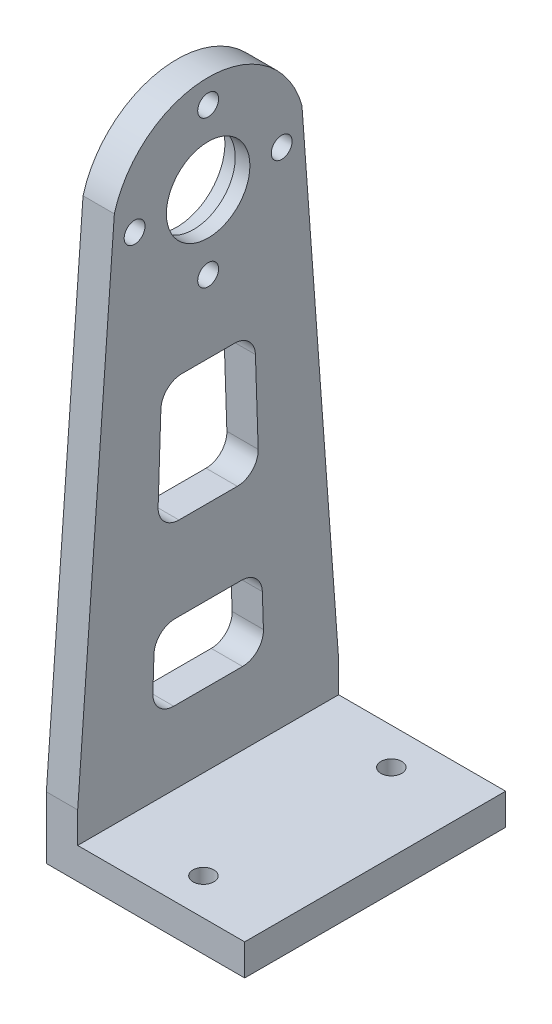
ISO-10303-21;
HEADER;
FILE_DESCRIPTION(('STEP AP214'),'2;1');
FILE_NAME('part.step','',(''),(''),'','','');
FILE_SCHEMA(('AUTOMOTIVE_DESIGN { 1 0 10303 214 1 1 1 1 }'));
ENDSEC;
DATA;
#1=APPLICATION_CONTEXT('core data for automotive mechanical design processes');
#2=APPLICATION_PROTOCOL_DEFINITION('international standard','automotive_design',2000,#1);
#3=PRODUCT_CONTEXT('',#1,'mechanical');
#4=PRODUCT('Part','Part','',(#3));
#5=PRODUCT_RELATED_PRODUCT_CATEGORY('part','',(#4));
#6=PRODUCT_DEFINITION_FORMATION('','',#4);
#7=PRODUCT_DEFINITION_CONTEXT('part definition',#1,'design');
#8=PRODUCT_DEFINITION('design','',#6,#7);
#9=PRODUCT_DEFINITION_SHAPE('','',#8);
#10=(LENGTH_UNIT() NAMED_UNIT(*) SI_UNIT(.MILLI.,.METRE.));
#11=(NAMED_UNIT(*) PLANE_ANGLE_UNIT() SI_UNIT($,.RADIAN.));
#12=(NAMED_UNIT(*) SI_UNIT($,.STERADIAN.) SOLID_ANGLE_UNIT());
#13=UNCERTAINTY_MEASURE_WITH_UNIT(LENGTH_MEASURE(1.E-05),#10,'distance_accuracy_value','');
#14=(GEOMETRIC_REPRESENTATION_CONTEXT(3) GLOBAL_UNCERTAINTY_ASSIGNED_CONTEXT((#13)) GLOBAL_UNIT_ASSIGNED_CONTEXT((#10,
#11,#12)) REPRESENTATION_CONTEXT('',''));
#15=CARTESIAN_POINT('',(0.,0.,0.));
#16=DIRECTION('',(0.,0.,1.));
#17=DIRECTION('',(1.,0.,0.));
#18=AXIS2_PLACEMENT_3D('',#15,#16,#17);
#19=CARTESIAN_POINT('',(15.5,-52.,0.));
#20=DIRECTION('',(-1.,0.,0.));
#21=DIRECTION('',(0.,0.,1.));
#22=AXIS2_PLACEMENT_3D('',#19,#20,#21);
#23=CYLINDRICAL_SURFACE('',#22,4.);
#24=CARTESIAN_POINT('',(16.5,-52.,0.));
#25=DIRECTION('',(-1.,0.,0.));
#26=DIRECTION('',(0.,0.,-1.));
#27=AXIS2_PLACEMENT_3D('',#24,#25,#26);
#28=CIRCLE('',#27,4.);
#29=CARTESIAN_POINT('',(16.5,-52.,-4.));
#30=VERTEX_POINT('',#29);
#31=EDGE_CURVE('E48',#30,#30,#28,.T.);
#32=ORIENTED_EDGE('',*,*,#31,.F.);
#33=EDGE_LOOP('',(#32));
#34=FACE_BOUND('',#33,.T.);
#35=CARTESIAN_POINT('',(15.1,-52.,0.));
#36=DIRECTION('',(-1.,0.,0.));
#37=DIRECTION('',(0.,0.,1.));
#38=AXIS2_PLACEMENT_3D('',#35,#36,#37);
#39=CIRCLE('',#38,4.);
#40=CARTESIAN_POINT('',(15.1,-52.,4.));
#41=VERTEX_POINT('',#40);
#42=EDGE_CURVE('E42',#41,#41,#39,.F.);
#43=ORIENTED_EDGE('',*,*,#42,.F.);
#44=EDGE_LOOP('',(#43));
#45=FACE_BOUND('',#44,.T.);
#46=ADVANCED_FACE('F39',(#34,#45),#23,.F.);
#47=CARTESIAN_POINT('',(16.5,-100.7,-12.5));
#48=DIRECTION('',(1.,0.,0.));
#49=DIRECTION('',(0.,-1.,0.));
#50=AXIS2_PLACEMENT_3D('',#47,#48,#49);
#51=PLANE('',#50);
#52=CARTESIAN_POINT('',(16.5,-59.0452123011725,1.54223501579341E-13));
#53=DIRECTION('',(-1.,0.,0.));
#54=DIRECTION('',(0.,0.,1.));
#55=AXIS2_PLACEMENT_3D('',#52,#53,#54);
#56=CIRCLE('',#55,1.);
#57=CARTESIAN_POINT('',(16.5,-59.0452123011725,1.00000000000015));
#58=VERTEX_POINT('',#57);
#59=EDGE_CURVE('E520',#58,#58,#56,.T.);
#60=ORIENTED_EDGE('',*,*,#59,.T.);
#61=EDGE_LOOP('',(#60));
#62=FACE_BOUND('',#61,.T.);
#63=CARTESIAN_POINT('',(16.5,-52.,7.04521230117253));
#64=DIRECTION('',(-1.,0.,0.));
#65=DIRECTION('',(0.,0.,1.));
#66=AXIS2_PLACEMENT_3D('',#63,#64,#65);
#67=CIRCLE('',#66,1.00000000000001);
#68=CARTESIAN_POINT('',(16.5,-52.,8.04521230117253));
#69=VERTEX_POINT('',#68);
#70=EDGE_CURVE('E526',#69,#69,#67,.T.);
#71=ORIENTED_EDGE('',*,*,#70,.T.);
#72=EDGE_LOOP('',(#71));
#73=FACE_BOUND('',#72,.T.);
#74=CARTESIAN_POINT('',(16.5,-52.0000000000001,-7.04521230117231));
#75=DIRECTION('',(-1.,0.,0.));
#76=DIRECTION('',(0.,0.,1.));
#77=AXIS2_PLACEMENT_3D('',#74,#75,#76);
#78=CIRCLE('',#77,1.);
#79=CARTESIAN_POINT('',(16.5,-52.0000000000001,-6.04521230117231));
#80=VERTEX_POINT('',#79);
#81=EDGE_CURVE('E532',#80,#80,#78,.T.);
#82=ORIENTED_EDGE('',*,*,#81,.T.);
#83=EDGE_LOOP('',(#82));
#84=FACE_BOUND('',#83,.T.);
#85=CARTESIAN_POINT('',(16.5,-44.9547876988277,0.));
#86=DIRECTION('',(-1.,0.,0.));
#87=DIRECTION('',(0.,0.,1.));
#88=AXIS2_PLACEMENT_3D('',#85,#86,#87);
#89=CIRCLE('',#88,1.);
#90=CARTESIAN_POINT('',(16.5,-44.9547876988277,1.00000000000001));
#91=VERTEX_POINT('',#90);
#92=EDGE_CURVE('E198',#91,#91,#89,.T.);
#93=ORIENTED_EDGE('',*,*,#92,.T.);
#94=EDGE_LOOP('',(#93));
#95=FACE_BOUND('',#94,.T.);
#96=DIRECTION('',(0.,-0.997297605701587,-0.0734675823876265));
#97=VECTOR('',#96,1.);
#98=CARTESIAN_POINT('',(16.5,-100.681108800183,-12.7564416540415));
#99=LINE('',#98,#97);
#100=CARTESIAN_POINT('',(16.5,-49.5,-8.986100377806));
#101=VERTEX_POINT('',#100);
#102=CARTESIAN_POINT('',(16.5,-97.2,-12.5));
#103=VERTEX_POINT('',#102);
#104=EDGE_CURVE('E173',#101,#103,#99,.T.);
#105=ORIENTED_EDGE('',*,*,#104,.F.);
#106=CARTESIAN_POINT('',(16.5,-52.0000000000001,0.));
#107=DIRECTION('',(1.,0.,0.));
#108=DIRECTION('',(0.,0.,-1.));
#109=AXIS2_PLACEMENT_3D('',#106,#107,#108);
#110=CIRCLE('',#109,9.32737905308911);
#111=CARTESIAN_POINT('',(16.5,-49.5,8.986100377806));
#112=VERTEX_POINT('',#111);
#113=EDGE_CURVE('E188',#101,#112,#110,.T.);
#114=ORIENTED_EDGE('',*,*,#113,.T.);
#115=DIRECTION('',(0.,0.997297605701587,-0.0734675823876265));
#116=VECTOR('',#115,1.);
#117=CARTESIAN_POINT('',(16.5,-98.8493826998868,12.6215045124945));
#118=LINE('',#117,#116);
#119=CARTESIAN_POINT('',(16.5,-97.2,12.5));
#120=VERTEX_POINT('',#119);
#121=EDGE_CURVE('E193',#120,#112,#118,.T.);
#122=ORIENTED_EDGE('',*,*,#121,.F.);
#123=DIRECTION('',(0.,1.,0.));
#124=VECTOR('',#123,1.);
#125=CARTESIAN_POINT('',(16.5,-100.7,12.5));
#126=LINE('',#125,#124);
#127=CARTESIAN_POINT('',(16.5,-100.149489742783,12.5));
#128=VERTEX_POINT('',#127);
#129=EDGE_CURVE('E153',#128,#120,#126,.T.);
#130=ORIENTED_EDGE('',*,*,#129,.F.);
#131=DIRECTION('',(0.,0.,1.));
#132=VECTOR('',#131,1.);
#133=CARTESIAN_POINT('',(16.5,-100.149489742783,12.5));
#134=LINE('',#133,#132);
#135=CARTESIAN_POINT('',(16.5,-100.149489742783,-12.5));
#136=VERTEX_POINT('',#135);
#137=EDGE_CURVE('E192',#136,#128,#134,.T.);
#138=ORIENTED_EDGE('',*,*,#137,.F.);
#139=DIRECTION('',(0.,1.,0.));
#140=VECTOR('',#139,1.);
#141=CARTESIAN_POINT('',(16.5,-100.7,-12.5));
#142=LINE('',#141,#140);
#143=EDGE_CURVE('E11',#136,#103,#142,.T.);
#144=ORIENTED_EDGE('',*,*,#143,.T.);
#145=EDGE_LOOP('',(#105,#114,#122,#130,#138,#144));
#146=FACE_BOUND('',#145,.T.);
#147=ORIENTED_EDGE('',*,*,#31,.T.);
#148=EDGE_LOOP('',(#147));
#149=FACE_BOUND('',#148,.T.);
#150=CARTESIAN_POINT('',(16.5,-91.2,-3.296767463509));
#151=DIRECTION('',(-1.,0.,0.));
#152=DIRECTION('',(0.,0.0330349000935773,-0.999454198738395));
#153=AXIS2_PLACEMENT_3D('',#150,#151,#152);
#154=CIRCLE('',#153,2.);
#155=CARTESIAN_POINT('',(16.5,-91.13393019981,-5.295675860986));
#156=VERTEX_POINT('',#155);
#157=CARTESIAN_POINT('',(16.5,-93.2,-3.296767463509));
#158=VERTEX_POINT('',#157);
#159=EDGE_CURVE('E260',#156,#158,#154,.T.);
#160=ORIENTED_EDGE('',*,*,#159,.T.);
#161=DIRECTION('',(0.,0.,-1.));
#162=VECTOR('',#161,1.);
#163=CARTESIAN_POINT('',(16.5,-93.2,3.296767463509));
#164=LINE('',#163,#162);
#165=CARTESIAN_POINT('',(16.5,-93.2,3.296767463509));
#166=VERTEX_POINT('',#165);
#167=EDGE_CURVE('E135',#166,#158,#164,.T.);
#168=ORIENTED_EDGE('',*,*,#167,.F.);
#169=CARTESIAN_POINT('',(16.5,-91.2,3.296767463509));
#170=DIRECTION('',(-1.,0.,0.));
#171=DIRECTION('',(0.,-1.,0.));
#172=AXIS2_PLACEMENT_3D('',#169,#170,#171);
#173=CIRCLE('',#172,2.);
#174=CARTESIAN_POINT('',(16.5,-91.13393019981,5.295675860986));
#175=VERTEX_POINT('',#174);
#176=EDGE_CURVE('E266',#166,#175,#173,.T.);
#177=ORIENTED_EDGE('',*,*,#176,.T.);
#178=DIRECTION('',(0.,-0.999454198738395,0.0330349000935798));
#179=VECTOR('',#178,1.);
#180=CARTESIAN_POINT('',(16.5,-87.93393019981,5.189906451609));
#181=LINE('',#180,#179);
#182=CARTESIAN_POINT('',(16.5,-87.93393019981,5.189906451609));
#183=VERTEX_POINT('',#182);
#184=EDGE_CURVE('E146',#183,#175,#181,.T.);
#185=ORIENTED_EDGE('',*,*,#184,.F.);
#186=CARTESIAN_POINT('',(16.5,-88.,3.190998054133));
#187=DIRECTION('',(-1.,0.,0.));
#188=DIRECTION('',(0.,0.0330349000935773,0.999454198738395));
#189=AXIS2_PLACEMENT_3D('',#186,#187,#188);
#190=CIRCLE('',#189,2.);
#191=CARTESIAN_POINT('',(16.5,-86.,3.190998054133));
#192=VERTEX_POINT('',#191);
#193=EDGE_CURVE('E127',#183,#192,#190,.T.);
#194=ORIENTED_EDGE('',*,*,#193,.T.);
#195=DIRECTION('',(0.,0.,1.));
#196=VECTOR('',#195,1.);
#197=CARTESIAN_POINT('',(16.5,-86.,-3.190998054133));
#198=LINE('',#197,#196);
#199=CARTESIAN_POINT('',(16.5,-86.,-3.190998054133));
#200=VERTEX_POINT('',#199);
#201=EDGE_CURVE('E102',#200,#192,#198,.T.);
#202=ORIENTED_EDGE('',*,*,#201,.F.);
#203=CARTESIAN_POINT('',(16.5,-88.,-3.190998054133));
#204=DIRECTION('',(-1.,0.,0.));
#205=DIRECTION('',(0.,1.,0.));
#206=AXIS2_PLACEMENT_3D('',#203,#204,#205);
#207=CIRCLE('',#206,2.);
#208=CARTESIAN_POINT('',(16.5,-87.93393019981,-5.189906451609));
#209=VERTEX_POINT('',#208);
#210=EDGE_CURVE('E121',#200,#209,#207,.T.);
#211=ORIENTED_EDGE('',*,*,#210,.T.);
#212=DIRECTION('',(0.,0.999454198738395,0.0330349000935798));
#213=VECTOR('',#212,1.);
#214=CARTESIAN_POINT('',(16.5,-91.13393019981,-5.295675860986));
#215=LINE('',#214,#213);
#216=EDGE_CURVE('E108',#156,#209,#215,.T.);
#217=ORIENTED_EDGE('',*,*,#216,.F.);
#218=EDGE_LOOP('',(#160,#168,#177,#185,#194,#202,#211,#217));
#219=FACE_BOUND('',#218,.T.);
#220=CARTESIAN_POINT('',(16.5,-68.,-2.529939245529));
#221=DIRECTION('',(-1.,0.,0.));
#222=DIRECTION('',(0.,1.,0.));
#223=AXIS2_PLACEMENT_3D('',#220,#221,#222);
#224=CIRCLE('',#223,2.);
#225=CARTESIAN_POINT('',(16.5,-66.,-2.529939245529));
#226=VERTEX_POINT('',#225);
#227=CARTESIAN_POINT('',(16.5,-67.93393019981,-4.528847643006));
#228=VERTEX_POINT('',#227);
#229=EDGE_CURVE('E240',#226,#228,#224,.T.);
#230=ORIENTED_EDGE('',*,*,#229,.T.);
#231=DIRECTION('',(0.,0.999454198738395,0.0330349000935798));
#232=VECTOR('',#231,1.);
#233=CARTESIAN_POINT('',(16.5,-75.93393019981,-4.793271166447));
#234=LINE('',#233,#232);
#235=CARTESIAN_POINT('',(16.5,-75.93393019981,-4.793271166447));
#236=VERTEX_POINT('',#235);
#237=EDGE_CURVE('E57',#236,#228,#234,.T.);
#238=ORIENTED_EDGE('',*,*,#237,.F.);
#239=CARTESIAN_POINT('',(16.5,-76.,-2.794362768971));
#240=DIRECTION('',(-1.,0.,0.));
#241=DIRECTION('',(0.,0.0330349000935773,-0.999454198738395));
#242=AXIS2_PLACEMENT_3D('',#239,#240,#241);
#243=CIRCLE('',#242,2.);
#244=CARTESIAN_POINT('',(16.5,-78.,-2.794362768971));
#245=VERTEX_POINT('',#244);
#246=EDGE_CURVE('E242',#236,#245,#243,.T.);
#247=ORIENTED_EDGE('',*,*,#246,.T.);
#248=DIRECTION('',(0.,0.,-1.));
#249=VECTOR('',#248,1.);
#250=CARTESIAN_POINT('',(16.5,-78.,2.794362768971));
#251=LINE('',#250,#249);
#252=CARTESIAN_POINT('',(16.5,-78.,2.794362768971));
#253=VERTEX_POINT('',#252);
#254=EDGE_CURVE('E249',#253,#245,#251,.T.);
#255=ORIENTED_EDGE('',*,*,#254,.F.);
#256=CARTESIAN_POINT('',(16.5,-76.,2.794362768971));
#257=DIRECTION('',(-1.,0.,0.));
#258=DIRECTION('',(0.,-1.,0.));
#259=AXIS2_PLACEMENT_3D('',#256,#257,#258);
#260=CIRCLE('',#259,2.);
#261=CARTESIAN_POINT('',(16.5,-75.93393019981,4.793271166447));
#262=VERTEX_POINT('',#261);
#263=EDGE_CURVE('E248',#253,#262,#260,.T.);
#264=ORIENTED_EDGE('',*,*,#263,.T.);
#265=DIRECTION('',(0.,-0.999454198738395,0.0330349000935798));
#266=VECTOR('',#265,1.);
#267=CARTESIAN_POINT('',(16.5,-67.93393019981,4.528847643006));
#268=LINE('',#267,#266);
#269=CARTESIAN_POINT('',(16.5,-67.93393019981,4.528847643006));
#270=VERTEX_POINT('',#269);
#271=EDGE_CURVE('E128',#270,#262,#268,.T.);
#272=ORIENTED_EDGE('',*,*,#271,.F.);
#273=CARTESIAN_POINT('',(16.5,-68.,2.529939245529));
#274=DIRECTION('',(-1.,0.,0.));
#275=DIRECTION('',(0.,0.0330349000935773,0.999454198738395));
#276=AXIS2_PLACEMENT_3D('',#273,#274,#275);
#277=CIRCLE('',#276,2.);
#278=CARTESIAN_POINT('',(16.5,-66.,2.529939245529));
#279=VERTEX_POINT('',#278);
#280=EDGE_CURVE('E255',#270,#279,#277,.T.);
#281=ORIENTED_EDGE('',*,*,#280,.T.);
#282=DIRECTION('',(0.,0.,1.));
#283=VECTOR('',#282,1.);
#284=CARTESIAN_POINT('',(16.5,-66.,-2.529939245529));
#285=LINE('',#284,#283);
#286=EDGE_CURVE('E261',#226,#279,#285,.T.);
#287=ORIENTED_EDGE('',*,*,#286,.F.);
#288=EDGE_LOOP('',(#230,#238,#247,#255,#264,#272,#281,#287));
#289=FACE_BOUND('',#288,.T.);
#290=ADVANCED_FACE('F122',(#62,#73,#84,#95,#146,#149,#219,#289),#51,.T.);
#291=CARTESIAN_POINT('',(15.5,-70.85,12.5));
#292=DIRECTION('',(0.,0.,-1.));
#293=DIRECTION('',(0.,-1.,0.));
#294=AXIS2_PLACEMENT_3D('',#291,#292,#293);
#295=PLANE('',#294);
#296=DIRECTION('',(-1.,0.,0.));
#297=VECTOR('',#296,1.);
#298=CARTESIAN_POINT('',(32.5,-100.149489742783,12.5));
#299=LINE('',#298,#297);
#300=CARTESIAN_POINT('',(32.5,-100.149489742783,12.5));
#301=VERTEX_POINT('',#300);
#302=EDGE_CURVE('E223',#301,#128,#299,.T.);
#303=ORIENTED_EDGE('',*,*,#302,.T.);
#304=ORIENTED_EDGE('',*,*,#129,.T.);
#305=DIRECTION('',(-1.,0.,0.));
#306=VECTOR('',#305,1.);
#307=CARTESIAN_POINT('',(16.5,-97.2,12.5));
#308=LINE('',#307,#306);
#309=CARTESIAN_POINT('',(13.5,-97.2,12.5));
#310=VERTEX_POINT('',#309);
#311=EDGE_CURVE('E159',#120,#310,#308,.T.);
#312=ORIENTED_EDGE('',*,*,#311,.T.);
#313=DIRECTION('',(0.,-1.,0.));
#314=VECTOR('',#313,1.);
#315=CARTESIAN_POINT('',(13.5,0.,12.5));
#316=LINE('',#315,#314);
#317=CARTESIAN_POINT('',(13.5,-103.149489742783,12.5));
#318=VERTEX_POINT('',#317);
#319=EDGE_CURVE('E384',#310,#318,#316,.T.);
#320=ORIENTED_EDGE('',*,*,#319,.T.);
#321=DIRECTION('',(-1.,0.,0.));
#322=VECTOR('',#321,1.);
#323=CARTESIAN_POINT('',(75.6884089130718,-103.149489742783,12.5));
#324=LINE('',#323,#322);
#325=CARTESIAN_POINT('',(32.5,-103.149489742783,12.5));
#326=VERTEX_POINT('',#325);
#327=EDGE_CURVE('E231',#326,#318,#324,.T.);
#328=ORIENTED_EDGE('',*,*,#327,.F.);
#329=DIRECTION('',(0.,-1.,0.));
#330=VECTOR('',#329,1.);
#331=CARTESIAN_POINT('',(32.5,-103.149489742783,12.5));
#332=LINE('',#331,#330);
#333=EDGE_CURVE('E211',#301,#326,#332,.T.);
#334=ORIENTED_EDGE('',*,*,#333,.F.);
#335=EDGE_LOOP('',(#303,#304,#312,#320,#328,#334));
#336=FACE_BOUND('',#335,.T.);
#337=ADVANCED_FACE('F376',(#336),#295,.F.);
#338=CARTESIAN_POINT('',(15.93933982822,-101.76066017178,-12.5));
#339=DIRECTION('',(0.,0.,-1.));
#340=DIRECTION('',(1.,0.,0.));
#341=AXIS2_PLACEMENT_3D('',#338,#339,#340);
#342=PLANE('',#341);
#343=DIRECTION('',(-1.,0.,0.));
#344=VECTOR('',#343,1.);
#345=CARTESIAN_POINT('',(75.6884089130718,-103.149489742783,-12.5));
#346=LINE('',#345,#344);
#347=CARTESIAN_POINT('',(32.5,-103.149489742783,-12.5));
#348=VERTEX_POINT('',#347);
#349=CARTESIAN_POINT('',(13.5,-103.149489742783,-12.5));
#350=VERTEX_POINT('',#349);
#351=EDGE_CURVE('E158',#348,#350,#346,.T.);
#352=ORIENTED_EDGE('',*,*,#351,.T.);
#353=DIRECTION('',(0.,1.,0.));
#354=VECTOR('',#353,1.);
#355=CARTESIAN_POINT('',(13.5,0.,-12.5));
#356=LINE('',#355,#354);
#357=CARTESIAN_POINT('',(13.5,-97.2,-12.5));
#358=VERTEX_POINT('',#357);
#359=EDGE_CURVE('E392',#350,#358,#356,.T.);
#360=ORIENTED_EDGE('',*,*,#359,.T.);
#361=DIRECTION('',(-1.,0.,0.));
#362=VECTOR('',#361,1.);
#363=CARTESIAN_POINT('',(16.5,-97.2,-12.5));
#364=LINE('',#363,#362);
#365=EDGE_CURVE('E162',#103,#358,#364,.T.);
#366=ORIENTED_EDGE('',*,*,#365,.F.);
#367=ORIENTED_EDGE('',*,*,#143,.F.);
#368=DIRECTION('',(-1.,0.,0.));
#369=VECTOR('',#368,1.);
#370=CARTESIAN_POINT('',(32.5,-100.149489742783,-12.5));
#371=LINE('',#370,#369);
#372=CARTESIAN_POINT('',(32.5,-100.149489742783,-12.5));
#373=VERTEX_POINT('',#372);
#374=EDGE_CURVE('E228',#373,#136,#371,.T.);
#375=ORIENTED_EDGE('',*,*,#374,.F.);
#376=DIRECTION('',(0.,1.,0.));
#377=VECTOR('',#376,1.);
#378=CARTESIAN_POINT('',(32.5,-100.149489742783,-12.5));
#379=LINE('',#378,#377);
#380=EDGE_CURVE('E217',#348,#373,#379,.T.);
#381=ORIENTED_EDGE('',*,*,#380,.F.);
#382=EDGE_LOOP('',(#352,#360,#366,#367,#375,#381));
#383=FACE_BOUND('',#382,.T.);
#384=ADVANCED_FACE('F477',(#383),#342,.T.);
#385=CARTESIAN_POINT('',(15.5,-72.,4.663243205897));
#386=DIRECTION('',(0.,0.0330349000935798,0.999454198738395));
#387=DIRECTION('',(0.,0.999454198738395,-0.0330349000935798));
#388=AXIS2_PLACEMENT_3D('',#385,#386,#387);
#389=PLANE('',#388);
#390=ORIENTED_EDGE('',*,*,#271,.T.);
#391=DIRECTION('',(-1.,0.,0.));
#392=VECTOR('',#391,1.);
#393=CARTESIAN_POINT('',(16.5,-75.93393019981,4.793271166447));
#394=LINE('',#393,#392);
#395=CARTESIAN_POINT('',(13.5,-75.93393019981,4.79327116644733));
#396=VERTEX_POINT('',#395);
#397=EDGE_CURVE('E257',#262,#396,#394,.T.);
#398=ORIENTED_EDGE('',*,*,#397,.T.);
#399=DIRECTION('',(0.,0.999454198738395,-0.0330349000935798));
#400=VECTOR('',#399,1.);
#401=CARTESIAN_POINT('',(13.5,0.0753917599162948,2.28093957557516));
#402=LINE('',#401,#400);
#403=CARTESIAN_POINT('',(13.5,-67.93393019981,4.5288476430057));
#404=VERTEX_POINT('',#403);
#405=EDGE_CURVE('E328',#396,#404,#402,.T.);
#406=ORIENTED_EDGE('',*,*,#405,.T.);
#407=DIRECTION('',(-1.,0.,0.));
#408=VECTOR('',#407,1.);
#409=CARTESIAN_POINT('',(16.5,-67.93393019981,4.528847643006));
#410=LINE('',#409,#408);
#411=EDGE_CURVE('E263',#270,#404,#410,.T.);
#412=ORIENTED_EDGE('',*,*,#411,.F.);
#413=EDGE_LOOP('',(#390,#398,#406,#412));
#414=FACE_BOUND('',#413,.T.);
#415=ADVANCED_FACE('F475',(#414),#389,.F.);
#416=CARTESIAN_POINT('',(118.162,-68.,2.529939245529));
#417=DIRECTION('',(-1.,0.,0.));
#418=DIRECTION('',(0.,-0.0330349000935773,-0.999454198738395));
#419=AXIS2_PLACEMENT_3D('',#416,#417,#418);
#420=CYLINDRICAL_SURFACE('',#419,2.);
#421=ORIENTED_EDGE('',*,*,#411,.T.);
#422=CARTESIAN_POINT('',(13.5,-68.,2.529939245529));
#423=DIRECTION('',(1.,0.,0.));
#424=DIRECTION('',(0.,0.,-1.));
#425=AXIS2_PLACEMENT_3D('',#422,#423,#424);
#426=CIRCLE('',#425,2.);
#427=CARTESIAN_POINT('',(13.5,-66.,2.529939245529));
#428=VERTEX_POINT('',#427);
#429=EDGE_CURVE('E207',#404,#428,#426,.F.);
#430=ORIENTED_EDGE('',*,*,#429,.T.);
#431=DIRECTION('',(-1.,0.,0.));
#432=VECTOR('',#431,1.);
#433=CARTESIAN_POINT('',(16.5,-66.,2.529939245529));
#434=LINE('',#433,#432);
#435=EDGE_CURVE('E264',#279,#428,#434,.T.);
#436=ORIENTED_EDGE('',*,*,#435,.F.);
#437=ORIENTED_EDGE('',*,*,#280,.F.);
#438=EDGE_LOOP('',(#421,#430,#436,#437));
#439=FACE_BOUND('',#438,.T.);
#440=ADVANCED_FACE('F339',(#439),#420,.F.);
#441=CARTESIAN_POINT('',(15.5,-66.,0.));
#442=DIRECTION('',(0.,1.,0.));
#443=DIRECTION('',(0.,0.,-1.));
#444=AXIS2_PLACEMENT_3D('',#441,#442,#443);
#445=PLANE('',#444);
#446=ORIENTED_EDGE('',*,*,#286,.T.);
#447=ORIENTED_EDGE('',*,*,#435,.T.);
#448=DIRECTION('',(0.,0.,-1.));
#449=VECTOR('',#448,1.);
#450=CARTESIAN_POINT('',(13.5,-66.,0.));
#451=LINE('',#450,#449);
#452=CARTESIAN_POINT('',(13.5,-66.,-2.529939245529));
#453=VERTEX_POINT('',#452);
#454=EDGE_CURVE('E308',#428,#453,#451,.T.);
#455=ORIENTED_EDGE('',*,*,#454,.T.);
#456=DIRECTION('',(-1.,0.,0.));
#457=VECTOR('',#456,1.);
#458=CARTESIAN_POINT('',(16.5,-66.,-2.529939245529));
#459=LINE('',#458,#457);
#460=EDGE_CURVE('E244',#226,#453,#459,.T.);
#461=ORIENTED_EDGE('',*,*,#460,.F.);
#462=EDGE_LOOP('',(#446,#447,#455,#461));
#463=FACE_BOUND('',#462,.T.);
#464=ADVANCED_FACE('F473',(#463),#445,.F.);
#465=CARTESIAN_POINT('',(118.162,-68.,-2.529939245529));
#466=DIRECTION('',(-1.,0.,0.));
#467=DIRECTION('',(0.,-1.,0.));
#468=AXIS2_PLACEMENT_3D('',#465,#466,#467);
#469=CYLINDRICAL_SURFACE('',#468,2.);
#470=ORIENTED_EDGE('',*,*,#460,.T.);
#471=CARTESIAN_POINT('',(13.5,-68.,-2.529939245529));
#472=DIRECTION('',(1.,0.,0.));
#473=DIRECTION('',(0.,0.,-1.));
#474=AXIS2_PLACEMENT_3D('',#471,#472,#473);
#475=CIRCLE('',#474,2.);
#476=CARTESIAN_POINT('',(13.5,-67.93393019981,-4.52884764300567));
#477=VERTEX_POINT('',#476);
#478=EDGE_CURVE('E311',#453,#477,#475,.F.);
#479=ORIENTED_EDGE('',*,*,#478,.T.);
#480=DIRECTION('',(-1.,0.,0.));
#481=VECTOR('',#480,1.);
#482=CARTESIAN_POINT('',(16.5,-67.93393019981,-4.528847643006));
#483=LINE('',#482,#481);
#484=EDGE_CURVE('E245',#228,#477,#483,.T.);
#485=ORIENTED_EDGE('',*,*,#484,.F.);
#486=ORIENTED_EDGE('',*,*,#229,.F.);
#487=EDGE_LOOP('',(#470,#479,#485,#486));
#488=FACE_BOUND('',#487,.T.);
#489=ADVANCED_FACE('F470',(#488),#469,.F.);
#490=CARTESIAN_POINT('',(15.5,-72.,-4.663243205897));
#491=DIRECTION('',(0.,0.0330349000935798,-0.999454198738395));
#492=DIRECTION('',(0.,-0.999454198738395,-0.0330349000935798));
#493=AXIS2_PLACEMENT_3D('',#490,#491,#492);
#494=PLANE('',#493);
#495=ORIENTED_EDGE('',*,*,#484,.T.);
#496=DIRECTION('',(0.,-0.999454198738395,-0.0330349000935798));
#497=VECTOR('',#496,1.);
#498=CARTESIAN_POINT('',(13.5,0.0753917599162838,-2.28093957557483));
#499=LINE('',#498,#497);
#500=CARTESIAN_POINT('',(13.5,-75.9339301998128,-4.79327116644779));
#501=VERTEX_POINT('',#500);
#502=EDGE_CURVE('E317',#477,#501,#499,.T.);
#503=ORIENTED_EDGE('',*,*,#502,.T.);
#504=DIRECTION('',(-1.,0.,0.));
#505=VECTOR('',#504,1.);
#506=CARTESIAN_POINT('',(16.5,-75.93393019981,-4.793271166447));
#507=LINE('',#506,#505);
#508=EDGE_CURVE('E251',#236,#501,#507,.T.);
#509=ORIENTED_EDGE('',*,*,#508,.F.);
#510=ORIENTED_EDGE('',*,*,#237,.T.);
#511=EDGE_LOOP('',(#495,#503,#509,#510));
#512=FACE_BOUND('',#511,.T.);
#513=ADVANCED_FACE('F466',(#512),#494,.F.);
#514=CARTESIAN_POINT('',(118.162,-76.,-2.794362768971));
#515=DIRECTION('',(-1.,0.,0.));
#516=DIRECTION('',(0.,-0.0330349000935773,0.999454198738395));
#517=AXIS2_PLACEMENT_3D('',#514,#515,#516);
#518=CYLINDRICAL_SURFACE('',#517,2.);
#519=ORIENTED_EDGE('',*,*,#508,.T.);
#520=CARTESIAN_POINT('',(13.5,-76.,-2.794362768971));
#521=DIRECTION('',(1.,0.,0.));
#522=DIRECTION('',(0.,0.,-1.));
#523=AXIS2_PLACEMENT_3D('',#520,#521,#522);
#524=CIRCLE('',#523,2.);
#525=CARTESIAN_POINT('',(13.5,-78.,-2.794362768971));
#526=VERTEX_POINT('',#525);
#527=EDGE_CURVE('E320',#501,#526,#524,.F.);
#528=ORIENTED_EDGE('',*,*,#527,.T.);
#529=DIRECTION('',(-1.,0.,0.));
#530=VECTOR('',#529,1.);
#531=CARTESIAN_POINT('',(16.5,-78.,-2.794362768971));
#532=LINE('',#531,#530);
#533=EDGE_CURVE('E252',#245,#526,#532,.T.);
#534=ORIENTED_EDGE('',*,*,#533,.F.);
#535=ORIENTED_EDGE('',*,*,#246,.F.);
#536=EDGE_LOOP('',(#519,#528,#534,#535));
#537=FACE_BOUND('',#536,.T.);
#538=ADVANCED_FACE('F464',(#537),#518,.F.);
#539=CARTESIAN_POINT('',(15.5,-78.,0.));
#540=DIRECTION('',(0.,-1.,0.));
#541=DIRECTION('',(0.,0.,1.));
#542=AXIS2_PLACEMENT_3D('',#539,#540,#541);
#543=PLANE('',#542);
#544=ORIENTED_EDGE('',*,*,#254,.T.);
#545=ORIENTED_EDGE('',*,*,#533,.T.);
#546=DIRECTION('',(0.,0.,1.));
#547=VECTOR('',#546,1.);
#548=CARTESIAN_POINT('',(13.5,-78.,0.));
#549=LINE('',#548,#547);
#550=CARTESIAN_POINT('',(13.5,-78.,2.794362768971));
#551=VERTEX_POINT('',#550);
#552=EDGE_CURVE('E323',#526,#551,#549,.T.);
#553=ORIENTED_EDGE('',*,*,#552,.T.);
#554=DIRECTION('',(-1.,0.,0.));
#555=VECTOR('',#554,1.);
#556=CARTESIAN_POINT('',(16.5,-78.,2.794362768971));
#557=LINE('',#556,#555);
#558=EDGE_CURVE('E272',#253,#551,#557,.T.);
#559=ORIENTED_EDGE('',*,*,#558,.F.);
#560=EDGE_LOOP('',(#544,#545,#553,#559));
#561=FACE_BOUND('',#560,.T.);
#562=ADVANCED_FACE('F460',(#561),#543,.F.);
#563=CARTESIAN_POINT('',(118.162,-76.,2.794362768971));
#564=DIRECTION('',(-1.,0.,0.));
#565=DIRECTION('',(0.,1.,0.));
#566=AXIS2_PLACEMENT_3D('',#563,#564,#565);
#567=CYLINDRICAL_SURFACE('',#566,2.);
#568=ORIENTED_EDGE('',*,*,#558,.T.);
#569=CARTESIAN_POINT('',(13.5,-76.,2.794362768971));
#570=DIRECTION('',(1.,0.,0.));
#571=DIRECTION('',(0.,0.,-1.));
#572=AXIS2_PLACEMENT_3D('',#569,#570,#571);
#573=CIRCLE('',#572,2.);
#574=EDGE_CURVE('E326',#551,#396,#573,.F.);
#575=ORIENTED_EDGE('',*,*,#574,.T.);
#576=ORIENTED_EDGE('',*,*,#397,.F.);
#577=ORIENTED_EDGE('',*,*,#263,.F.);
#578=EDGE_LOOP('',(#568,#575,#576,#577));
#579=FACE_BOUND('',#578,.T.);
#580=ADVANCED_FACE('F455',(#579),#567,.F.);
#581=CARTESIAN_POINT('',(15.5,-86.,0.));
#582=DIRECTION('',(0.,1.,0.));
#583=DIRECTION('',(0.,0.,-1.));
#584=AXIS2_PLACEMENT_3D('',#581,#582,#583);
#585=PLANE('',#584);
#586=ORIENTED_EDGE('',*,*,#201,.T.);
#587=DIRECTION('',(-1.,0.,0.));
#588=VECTOR('',#587,1.);
#589=CARTESIAN_POINT('',(16.5,-86.,3.190998054133));
#590=LINE('',#589,#588);
#591=CARTESIAN_POINT('',(13.5,-86.,3.190998054133));
#592=VERTEX_POINT('',#591);
#593=EDGE_CURVE('E273',#192,#592,#590,.T.);
#594=ORIENTED_EDGE('',*,*,#593,.T.);
#595=DIRECTION('',(0.,0.,-1.));
#596=VECTOR('',#595,1.);
#597=CARTESIAN_POINT('',(13.5,-86.,0.));
#598=LINE('',#597,#596);
#599=CARTESIAN_POINT('',(13.5,-86.,-3.190998054133));
#600=VERTEX_POINT('',#599);
#601=EDGE_CURVE('E297',#592,#600,#598,.T.);
#602=ORIENTED_EDGE('',*,*,#601,.T.);
#603=DIRECTION('',(-1.,0.,0.));
#604=VECTOR('',#603,1.);
#605=CARTESIAN_POINT('',(16.5,-86.,-3.190998054133));
#606=LINE('',#605,#604);
#607=EDGE_CURVE('E119',#200,#600,#606,.T.);
#608=ORIENTED_EDGE('',*,*,#607,.F.);
#609=EDGE_LOOP('',(#586,#594,#602,#608));
#610=FACE_BOUND('',#609,.T.);
#611=ADVANCED_FACE('F298',(#610),#585,.F.);
#612=CARTESIAN_POINT('',(118.162,-88.,-3.190998054133));
#613=DIRECTION('',(-1.,0.,0.));
#614=DIRECTION('',(0.,-1.,0.));
#615=AXIS2_PLACEMENT_3D('',#612,#613,#614);
#616=CYLINDRICAL_SURFACE('',#615,2.);
#617=ORIENTED_EDGE('',*,*,#607,.T.);
#618=CARTESIAN_POINT('',(13.5,-88.,-3.190998054133));
#619=DIRECTION('',(1.,0.,0.));
#620=DIRECTION('',(0.,0.,-1.));
#621=AXIS2_PLACEMENT_3D('',#618,#619,#620);
#622=CIRCLE('',#621,2.);
#623=CARTESIAN_POINT('',(13.5,-87.93393019981,-5.18990645160947));
#624=VERTEX_POINT('',#623);
#625=EDGE_CURVE('E133',#600,#624,#622,.F.);
#626=ORIENTED_EDGE('',*,*,#625,.T.);
#627=DIRECTION('',(-1.,0.,0.));
#628=VECTOR('',#627,1.);
#629=CARTESIAN_POINT('',(16.5,-87.93393019981,-5.189906451609));
#630=LINE('',#629,#628);
#631=EDGE_CURVE('E113',#209,#624,#630,.T.);
#632=ORIENTED_EDGE('',*,*,#631,.F.);
#633=ORIENTED_EDGE('',*,*,#210,.F.);
#634=EDGE_LOOP('',(#617,#626,#632,#633));
#635=FACE_BOUND('',#634,.T.);
#636=ADVANCED_FACE('F131',(#635),#616,.F.);
#637=CARTESIAN_POINT('',(15.5,-89.6,-5.244974957468));
#638=DIRECTION('',(0.,0.0330349000935798,-0.999454198738395));
#639=DIRECTION('',(0.,-0.999454198738395,-0.0330349000935798));
#640=AXIS2_PLACEMENT_3D('',#637,#638,#639);
#641=PLANE('',#640);
#642=ORIENTED_EDGE('',*,*,#631,.T.);
#643=DIRECTION('',(0.,-0.999454198738395,-0.0330349000935798));
#644=VECTOR('',#643,1.);
#645=CARTESIAN_POINT('',(13.5,0.0753917599162994,-2.2809395755753));
#646=LINE('',#645,#644);
#647=CARTESIAN_POINT('',(13.5,-91.13393019981,-5.295675860986));
#648=VERTEX_POINT('',#647);
#649=EDGE_CURVE('E307',#624,#648,#646,.T.);
#650=ORIENTED_EDGE('',*,*,#649,.T.);
#651=DIRECTION('',(-1.,0.,0.));
#652=VECTOR('',#651,1.);
#653=CARTESIAN_POINT('',(16.5,-91.13393019981,-5.295675860986));
#654=LINE('',#653,#652);
#655=EDGE_CURVE('E116',#156,#648,#654,.T.);
#656=ORIENTED_EDGE('',*,*,#655,.F.);
#657=ORIENTED_EDGE('',*,*,#216,.T.);
#658=EDGE_LOOP('',(#642,#650,#656,#657));
#659=FACE_BOUND('',#658,.T.);
#660=ADVANCED_FACE('F109',(#659),#641,.F.);
#661=CARTESIAN_POINT('',(118.162,-91.2,-3.296767463509));
#662=DIRECTION('',(-1.,0.,0.));
#663=DIRECTION('',(0.,-0.0330349000935773,0.999454198738395));
#664=AXIS2_PLACEMENT_3D('',#661,#662,#663);
#665=CYLINDRICAL_SURFACE('',#664,2.);
#666=ORIENTED_EDGE('',*,*,#655,.T.);
#667=CARTESIAN_POINT('',(13.5,-91.2,-3.296767463509));
#668=DIRECTION('',(1.,0.,0.));
#669=DIRECTION('',(0.,0.,-1.));
#670=AXIS2_PLACEMENT_3D('',#667,#668,#669);
#671=CIRCLE('',#670,2.);
#672=CARTESIAN_POINT('',(13.5,-93.2,-3.296767463509));
#673=VERTEX_POINT('',#672);
#674=EDGE_CURVE('E400',#648,#673,#671,.F.);
#675=ORIENTED_EDGE('',*,*,#674,.T.);
#676=DIRECTION('',(-1.,0.,0.));
#677=VECTOR('',#676,1.);
#678=CARTESIAN_POINT('',(16.5,-93.2,-3.296767463509));
#679=LINE('',#678,#677);
#680=EDGE_CURVE('E140',#158,#673,#679,.T.);
#681=ORIENTED_EDGE('',*,*,#680,.F.);
#682=ORIENTED_EDGE('',*,*,#159,.F.);
#683=EDGE_LOOP('',(#666,#675,#681,#682));
#684=FACE_BOUND('',#683,.T.);
#685=ADVANCED_FACE('F439',(#684),#665,.F.);
#686=CARTESIAN_POINT('',(15.5,-93.2,0.));
#687=DIRECTION('',(0.,-1.,0.));
#688=DIRECTION('',(0.,0.,1.));
#689=AXIS2_PLACEMENT_3D('',#686,#687,#688);
#690=PLANE('',#689);
#691=ORIENTED_EDGE('',*,*,#167,.T.);
#692=ORIENTED_EDGE('',*,*,#680,.T.);
#693=DIRECTION('',(0.,0.,1.));
#694=VECTOR('',#693,1.);
#695=CARTESIAN_POINT('',(13.5,-93.2,0.));
#696=LINE('',#695,#694);
#697=CARTESIAN_POINT('',(13.5,-93.2,3.296767463509));
#698=VERTEX_POINT('',#697);
#699=EDGE_CURVE('E403',#673,#698,#696,.T.);
#700=ORIENTED_EDGE('',*,*,#699,.T.);
#701=DIRECTION('',(-1.,0.,0.));
#702=VECTOR('',#701,1.);
#703=CARTESIAN_POINT('',(16.5,-93.2,3.296767463509));
#704=LINE('',#703,#702);
#705=EDGE_CURVE('E143',#166,#698,#704,.T.);
#706=ORIENTED_EDGE('',*,*,#705,.F.);
#707=EDGE_LOOP('',(#691,#692,#700,#706));
#708=FACE_BOUND('',#707,.T.);
#709=ADVANCED_FACE('F434',(#708),#690,.F.);
#710=CARTESIAN_POINT('',(118.162,-91.2,3.296767463509));
#711=DIRECTION('',(-1.,0.,0.));
#712=DIRECTION('',(0.,1.,0.));
#713=AXIS2_PLACEMENT_3D('',#710,#711,#712);
#714=CYLINDRICAL_SURFACE('',#713,2.);
#715=ORIENTED_EDGE('',*,*,#705,.T.);
#716=CARTESIAN_POINT('',(13.5,-91.2,3.296767463509));
#717=DIRECTION('',(1.,0.,0.));
#718=DIRECTION('',(0.,0.,-1.));
#719=AXIS2_PLACEMENT_3D('',#716,#717,#718);
#720=CIRCLE('',#719,2.);
#721=CARTESIAN_POINT('',(13.5,-91.13393019981,5.29567586098553));
#722=VERTEX_POINT('',#721);
#723=EDGE_CURVE('E406',#698,#722,#720,.F.);
#724=ORIENTED_EDGE('',*,*,#723,.T.);
#725=DIRECTION('',(-1.,0.,0.));
#726=VECTOR('',#725,1.);
#727=CARTESIAN_POINT('',(16.5,-91.13393019981,5.295675860986));
#728=LINE('',#727,#726);
#729=EDGE_CURVE('E147',#175,#722,#728,.T.);
#730=ORIENTED_EDGE('',*,*,#729,.F.);
#731=ORIENTED_EDGE('',*,*,#176,.F.);
#732=EDGE_LOOP('',(#715,#724,#730,#731));
#733=FACE_BOUND('',#732,.T.);
#734=ADVANCED_FACE('F428',(#733),#714,.F.);
#735=CARTESIAN_POINT('',(15.5,-89.6,5.244974957468));
#736=DIRECTION('',(0.,0.0330349000935798,0.999454198738395));
#737=DIRECTION('',(0.,0.999454198738395,-0.0330349000935798));
#738=AXIS2_PLACEMENT_3D('',#735,#736,#737);
#739=PLANE('',#738);
#740=ORIENTED_EDGE('',*,*,#184,.T.);
#741=ORIENTED_EDGE('',*,*,#729,.T.);
#742=DIRECTION('',(0.,0.999454198738395,-0.0330349000935798));
#743=VECTOR('',#742,1.);
#744=CARTESIAN_POINT('',(13.5,0.075391759916284,2.28093957557484));
#745=LINE('',#744,#743);
#746=CARTESIAN_POINT('',(13.5,-87.93393019981,5.1899064516097));
#747=VERTEX_POINT('',#746);
#748=EDGE_CURVE('E409',#722,#747,#745,.T.);
#749=ORIENTED_EDGE('',*,*,#748,.T.);
#750=DIRECTION('',(-1.,0.,0.));
#751=VECTOR('',#750,1.);
#752=CARTESIAN_POINT('',(16.5,-87.93393019981,5.189906451609));
#753=LINE('',#752,#751);
#754=EDGE_CURVE('E150',#183,#747,#753,.T.);
#755=ORIENTED_EDGE('',*,*,#754,.F.);
#756=EDGE_LOOP('',(#740,#741,#749,#755));
#757=FACE_BOUND('',#756,.T.);
#758=ADVANCED_FACE('F422',(#757),#739,.F.);
#759=CARTESIAN_POINT('',(118.162,-88.,3.190998054133));
#760=DIRECTION('',(-1.,0.,0.));
#761=DIRECTION('',(0.,-0.0330349000935773,-0.999454198738395));
#762=AXIS2_PLACEMENT_3D('',#759,#760,#761);
#763=CYLINDRICAL_SURFACE('',#762,2.);
#764=ORIENTED_EDGE('',*,*,#754,.T.);
#765=CARTESIAN_POINT('',(13.5,-88.,3.190998054133));
#766=DIRECTION('',(1.,0.,0.));
#767=DIRECTION('',(0.,0.,-1.));
#768=AXIS2_PLACEMENT_3D('',#765,#766,#767);
#769=CIRCLE('',#768,2.);
#770=EDGE_CURVE('E302',#747,#592,#769,.F.);
#771=ORIENTED_EDGE('',*,*,#770,.T.);
#772=ORIENTED_EDGE('',*,*,#593,.F.);
#773=ORIENTED_EDGE('',*,*,#193,.F.);
#774=EDGE_LOOP('',(#764,#771,#772,#773));
#775=FACE_BOUND('',#774,.T.);
#776=ADVANCED_FACE('F412',(#775),#763,.F.);
#777=CARTESIAN_POINT('',(75.6884089130718,-103.149489742783,-12.5));
#778=DIRECTION('',(0.,-1.,0.));
#779=DIRECTION('',(0.,0.,-1.));
#780=AXIS2_PLACEMENT_3D('',#777,#778,#779);
#781=PLANE('',#780);
#782=CARTESIAN_POINT('',(25.0500000000001,-103.149489742783,-9.00000000000004));
#783=DIRECTION('',(0.,-1.,0.));
#784=DIRECTION('',(0.,0.,-1.));
#785=AXIS2_PLACEMENT_3D('',#782,#783,#784);
#786=CIRCLE('',#785,0.999999999999619);
#787=CARTESIAN_POINT('',(25.0500000000001,-103.149489742783,-9.99999999999966));
#788=VERTEX_POINT('',#787);
#789=EDGE_CURVE('E500',#788,#788,#786,.T.);
#790=ORIENTED_EDGE('',*,*,#789,.F.);
#791=EDGE_LOOP('',(#790));
#792=FACE_BOUND('',#791,.T.);
#793=CARTESIAN_POINT('',(25.0500000000002,-103.149489742783,8.99999999999995));
#794=DIRECTION('',(0.,-1.,0.));
#795=DIRECTION('',(0.,0.,-1.));
#796=AXIS2_PLACEMENT_3D('',#793,#794,#795);
#797=CIRCLE('',#796,0.9999999999995);
#798=CARTESIAN_POINT('',(25.0500000000002,-103.149489742783,8.00000000000045));
#799=VERTEX_POINT('',#798);
#800=EDGE_CURVE('E515',#799,#799,#797,.T.);
#801=ORIENTED_EDGE('',*,*,#800,.F.);
#802=EDGE_LOOP('',(#801));
#803=FACE_BOUND('',#802,.T.);
#804=ORIENTED_EDGE('',*,*,#351,.F.);
#805=DIRECTION('',(0.,0.,-1.));
#806=VECTOR('',#805,1.);
#807=CARTESIAN_POINT('',(32.5,-103.149489742783,-12.5));
#808=LINE('',#807,#806);
#809=EDGE_CURVE('E214',#326,#348,#808,.T.);
#810=ORIENTED_EDGE('',*,*,#809,.F.);
#811=ORIENTED_EDGE('',*,*,#327,.T.);
#812=DIRECTION('',(0.,0.,-1.));
#813=VECTOR('',#812,1.);
#814=CARTESIAN_POINT('',(13.5,-103.149489742783,-12.5));
#815=LINE('',#814,#813);
#816=EDGE_CURVE('E391',#318,#350,#815,.T.);
#817=ORIENTED_EDGE('',*,*,#816,.T.);
#818=EDGE_LOOP('',(#804,#810,#811,#817));
#819=FACE_BOUND('',#818,.T.);
#820=ADVANCED_FACE('F567',(#792,#803,#819),#781,.T.);
#821=CARTESIAN_POINT('',(32.5,-100.149489742783,12.5));
#822=DIRECTION('',(0.,-1.,0.));
#823=DIRECTION('',(0.,0.,-1.));
#824=AXIS2_PLACEMENT_3D('',#821,#822,#823);
#825=PLANE('',#824);
#826=CARTESIAN_POINT('',(25.0500000000001,-100.149489742783,-9.00000000000004));
#827=DIRECTION('',(0.,1.,0.));
#828=DIRECTION('',(0.,0.,1.));
#829=AXIS2_PLACEMENT_3D('',#826,#827,#828);
#830=CIRCLE('',#829,0.999999999999619);
#831=CARTESIAN_POINT('',(25.0500000000001,-100.149489742783,-8.00000000000042));
#832=VERTEX_POINT('',#831);
#833=EDGE_CURVE('E497',#832,#832,#830,.T.);
#834=ORIENTED_EDGE('',*,*,#833,.F.);
#835=EDGE_LOOP('',(#834));
#836=FACE_BOUND('',#835,.T.);
#837=CARTESIAN_POINT('',(25.0500000000002,-100.149489742783,8.99999999999995));
#838=DIRECTION('',(0.,1.,0.));
#839=DIRECTION('',(0.,0.,1.));
#840=AXIS2_PLACEMENT_3D('',#837,#838,#839);
#841=CIRCLE('',#840,0.9999999999995);
#842=CARTESIAN_POINT('',(25.0500000000002,-100.149489742783,9.99999999999945));
#843=VERTEX_POINT('',#842);
#844=EDGE_CURVE('E512',#843,#843,#841,.T.);
#845=ORIENTED_EDGE('',*,*,#844,.F.);
#846=EDGE_LOOP('',(#845));
#847=FACE_BOUND('',#846,.T.);
#848=ORIENTED_EDGE('',*,*,#137,.T.);
#849=ORIENTED_EDGE('',*,*,#302,.F.);
#850=DIRECTION('',(0.,0.,1.));
#851=VECTOR('',#850,1.);
#852=CARTESIAN_POINT('',(32.5,-100.149489742783,12.5));
#853=LINE('',#852,#851);
#854=EDGE_CURVE('E220',#373,#301,#853,.T.);
#855=ORIENTED_EDGE('',*,*,#854,.F.);
#856=ORIENTED_EDGE('',*,*,#374,.T.);
#857=EDGE_LOOP('',(#848,#849,#855,#856));
#858=FACE_BOUND('',#857,.T.);
#859=ADVANCED_FACE('F370',(#836,#847,#858),#825,.F.);
#860=CARTESIAN_POINT('',(32.5,0.,0.));
#861=DIRECTION('',(-1.,0.,0.));
#862=DIRECTION('',(0.,0.,1.));
#863=AXIS2_PLACEMENT_3D('',#860,#861,#862);
#864=PLANE('',#863);
#865=ORIENTED_EDGE('',*,*,#333,.T.);
#866=ORIENTED_EDGE('',*,*,#809,.T.);
#867=ORIENTED_EDGE('',*,*,#380,.T.);
#868=ORIENTED_EDGE('',*,*,#854,.T.);
#869=EDGE_LOOP('',(#865,#866,#867,#868));
#870=FACE_BOUND('',#869,.T.);
#871=ADVANCED_FACE('F561',(#870),#864,.F.);
#872=CARTESIAN_POINT('',(22.,-49.5,-8.986100377806));
#873=DIRECTION('',(0.,-0.0734675823876265,0.997297605701587));
#874=DIRECTION('',(0.,-0.997297605701587,-0.0734675823876265));
#875=AXIS2_PLACEMENT_3D('',#872,#873,#874);
#876=PLANE('',#875);
#877=ORIENTED_EDGE('',*,*,#104,.T.);
#878=ORIENTED_EDGE('',*,*,#365,.T.);
#879=DIRECTION('',(0.,0.997297605701587,0.0734675823876265));
#880=VECTOR('',#879,1.);
#881=CARTESIAN_POINT('',(13.5,0.391227443813302,-5.31078035127329));
#882=LINE('',#881,#880);
#883=CARTESIAN_POINT('',(13.5,-49.5,-8.986100377806));
#884=VERTEX_POINT('',#883);
#885=EDGE_CURVE('E176',#358,#884,#882,.T.);
#886=ORIENTED_EDGE('',*,*,#885,.T.);
#887=DIRECTION('',(1.,0.,0.));
#888=VECTOR('',#887,1.);
#889=CARTESIAN_POINT('',(14.5,-49.5,-8.986100377806));
#890=LINE('',#889,#888);
#891=EDGE_CURVE('E157',#884,#101,#890,.T.);
#892=ORIENTED_EDGE('',*,*,#891,.T.);
#893=EDGE_LOOP('',(#877,#878,#886,#892));
#894=FACE_BOUND('',#893,.T.);
#895=ADVANCED_FACE('F171',(#894),#876,.F.);
#896=CARTESIAN_POINT('',(22.,-49.5,8.986100377806));
#897=DIRECTION('',(0.,-0.0734675823876265,-0.997297605701587));
#898=DIRECTION('',(0.,0.997297605701587,-0.0734675823876265));
#899=AXIS2_PLACEMENT_3D('',#896,#897,#898);
#900=PLANE('',#899);
#901=ORIENTED_EDGE('',*,*,#121,.T.);
#902=DIRECTION('',(1.,0.,0.));
#903=VECTOR('',#902,1.);
#904=CARTESIAN_POINT('',(14.5,-49.5,8.986100377806));
#905=LINE('',#904,#903);
#906=CARTESIAN_POINT('',(13.5,-49.5,8.986100377806));
#907=VERTEX_POINT('',#906);
#908=EDGE_CURVE('E154',#907,#112,#905,.T.);
#909=ORIENTED_EDGE('',*,*,#908,.F.);
#910=DIRECTION('',(0.,-0.997297605701587,0.0734675823876265));
#911=VECTOR('',#910,1.);
#912=CARTESIAN_POINT('',(13.5,0.391227443813302,5.31078035127329));
#913=LINE('',#912,#911);
#914=EDGE_CURVE('E200',#907,#310,#913,.T.);
#915=ORIENTED_EDGE('',*,*,#914,.T.);
#916=ORIENTED_EDGE('',*,*,#311,.F.);
#917=EDGE_LOOP('',(#901,#909,#915,#916));
#918=FACE_BOUND('',#917,.T.);
#919=ADVANCED_FACE('F378',(#918),#900,.F.);
#920=CARTESIAN_POINT('',(13.5,-52.0000000000001,0.));
#921=DIRECTION('',(1.,0.,0.));
#922=DIRECTION('',(0.,0.,-1.));
#923=AXIS2_PLACEMENT_3D('',#920,#921,#922);
#924=CYLINDRICAL_SURFACE('',#923,9.32737905308911);
#925=ORIENTED_EDGE('',*,*,#113,.F.);
#926=ORIENTED_EDGE('',*,*,#891,.F.);
#927=CARTESIAN_POINT('',(13.5,-52.0000000000001,0.));
#928=DIRECTION('',(1.,0.,0.));
#929=DIRECTION('',(0.,0.,-1.));
#930=AXIS2_PLACEMENT_3D('',#927,#928,#929);
#931=CIRCLE('',#930,9.32737905308911);
#932=EDGE_CURVE('E197',#884,#907,#931,.T.);
#933=ORIENTED_EDGE('',*,*,#932,.T.);
#934=ORIENTED_EDGE('',*,*,#908,.T.);
#935=EDGE_LOOP('',(#925,#926,#933,#934));
#936=FACE_BOUND('',#935,.T.);
#937=ADVANCED_FACE('F195',(#936),#924,.T.);
#938=CARTESIAN_POINT('',(13.5,0.,0.));
#939=DIRECTION('',(1.,0.,0.));
#940=DIRECTION('',(0.,0.,-1.));
#941=AXIS2_PLACEMENT_3D('',#938,#939,#940);
#942=PLANE('',#941);
#943=CARTESIAN_POINT('',(13.5,-52.0000000000001,0.));
#944=DIRECTION('',(-1.,0.,0.));
#945=DIRECTION('',(0.,0.,1.));
#946=AXIS2_PLACEMENT_3D('',#943,#944,#945);
#947=CIRCLE('',#946,4.6);
#948=CARTESIAN_POINT('',(13.5,-52.0000000000001,4.6));
#949=VERTEX_POINT('',#948);
#950=EDGE_CURVE('E503',#949,#949,#947,.T.);
#951=ORIENTED_EDGE('',*,*,#950,.F.);
#952=EDGE_LOOP('',(#951));
#953=FACE_BOUND('',#952,.T.);
#954=CARTESIAN_POINT('',(13.5,-59.0452123011725,1.54223501579341E-13));
#955=DIRECTION('',(-1.,0.,0.));
#956=DIRECTION('',(0.,0.,1.));
#957=AXIS2_PLACEMENT_3D('',#954,#955,#956);
#958=CIRCLE('',#957,1.);
#959=CARTESIAN_POINT('',(13.5,-59.0452123011725,1.00000000000015));
#960=VERTEX_POINT('',#959);
#961=EDGE_CURVE('E519',#960,#960,#958,.T.);
#962=ORIENTED_EDGE('',*,*,#961,.F.);
#963=EDGE_LOOP('',(#962));
#964=FACE_BOUND('',#963,.T.);
#965=CARTESIAN_POINT('',(13.5,-52.,7.04521230117253));
#966=DIRECTION('',(-1.,0.,0.));
#967=DIRECTION('',(0.,0.,1.));
#968=AXIS2_PLACEMENT_3D('',#965,#966,#967);
#969=CIRCLE('',#968,1.00000000000001);
#970=CARTESIAN_POINT('',(13.5,-52.,8.04521230117253));
#971=VERTEX_POINT('',#970);
#972=EDGE_CURVE('E523',#971,#971,#969,.T.);
#973=ORIENTED_EDGE('',*,*,#972,.F.);
#974=EDGE_LOOP('',(#973));
#975=FACE_BOUND('',#974,.T.);
#976=CARTESIAN_POINT('',(13.5,-52.0000000000001,-7.04521230117231));
#977=DIRECTION('',(-1.,0.,0.));
#978=DIRECTION('',(0.,0.,1.));
#979=AXIS2_PLACEMENT_3D('',#976,#977,#978);
#980=CIRCLE('',#979,1.);
#981=CARTESIAN_POINT('',(13.5,-52.0000000000001,-6.04521230117231));
#982=VERTEX_POINT('',#981);
#983=EDGE_CURVE('E529',#982,#982,#980,.T.);
#984=ORIENTED_EDGE('',*,*,#983,.F.);
#985=EDGE_LOOP('',(#984));
#986=FACE_BOUND('',#985,.T.);
#987=CARTESIAN_POINT('',(13.5,-44.9547876988277,0.));
#988=DIRECTION('',(-1.,0.,0.));
#989=DIRECTION('',(0.,0.,1.));
#990=AXIS2_PLACEMENT_3D('',#987,#988,#989);
#991=CIRCLE('',#990,1.);
#992=CARTESIAN_POINT('',(13.5,-44.9547876988277,1.00000000000001));
#993=VERTEX_POINT('',#992);
#994=EDGE_CURVE('E203',#993,#993,#991,.T.);
#995=ORIENTED_EDGE('',*,*,#994,.F.);
#996=EDGE_LOOP('',(#995));
#997=FACE_BOUND('',#996,.T.);
#998=ORIENTED_EDGE('',*,*,#932,.F.);
#999=ORIENTED_EDGE('',*,*,#885,.F.);
#1000=ORIENTED_EDGE('',*,*,#359,.F.);
#1001=ORIENTED_EDGE('',*,*,#816,.F.);
#1002=ORIENTED_EDGE('',*,*,#319,.F.);
#1003=ORIENTED_EDGE('',*,*,#914,.F.);
#1004=EDGE_LOOP('',(#998,#999,#1000,#1001,#1002,#1003));
#1005=FACE_BOUND('',#1004,.T.);
#1006=ORIENTED_EDGE('',*,*,#649,.F.);
#1007=ORIENTED_EDGE('',*,*,#625,.F.);
#1008=ORIENTED_EDGE('',*,*,#601,.F.);
#1009=ORIENTED_EDGE('',*,*,#770,.F.);
#1010=ORIENTED_EDGE('',*,*,#748,.F.);
#1011=ORIENTED_EDGE('',*,*,#723,.F.);
#1012=ORIENTED_EDGE('',*,*,#699,.F.);
#1013=ORIENTED_EDGE('',*,*,#674,.F.);
#1014=EDGE_LOOP('',(#1006,#1007,#1008,#1009,#1010,#1011,#1012,#1013));
#1015=FACE_BOUND('',#1014,.T.);
#1016=ORIENTED_EDGE('',*,*,#454,.F.);
#1017=ORIENTED_EDGE('',*,*,#429,.F.);
#1018=ORIENTED_EDGE('',*,*,#405,.F.);
#1019=ORIENTED_EDGE('',*,*,#574,.F.);
#1020=ORIENTED_EDGE('',*,*,#552,.F.);
#1021=ORIENTED_EDGE('',*,*,#527,.F.);
#1022=ORIENTED_EDGE('',*,*,#502,.F.);
#1023=ORIENTED_EDGE('',*,*,#478,.F.);
#1024=EDGE_LOOP('',(#1016,#1017,#1018,#1019,#1020,#1021,#1022,#1023));
#1025=FACE_BOUND('',#1024,.T.);
#1026=ADVANCED_FACE('F304',(#953,#964,#975,#986,#997,#1005,#1015,#1025),#942,.F.);
#1027=CARTESIAN_POINT('',(16.5,-44.9547876988277,0.));
#1028=DIRECTION('',(-1.,0.,0.));
#1029=DIRECTION('',(0.,0.,1.));
#1030=AXIS2_PLACEMENT_3D('',#1027,#1028,#1029);
#1031=CYLINDRICAL_SURFACE('',#1030,1.);
#1032=ORIENTED_EDGE('',*,*,#92,.F.);
#1033=EDGE_LOOP('',(#1032));
#1034=FACE_BOUND('',#1033,.T.);
#1035=ORIENTED_EDGE('',*,*,#994,.T.);
#1036=EDGE_LOOP('',(#1035));
#1037=FACE_BOUND('',#1036,.T.);
#1038=ADVANCED_FACE('F540',(#1034,#1037),#1031,.F.);
#1039=CARTESIAN_POINT('',(16.5,-52.0000000000001,-7.04521230117231));
#1040=DIRECTION('',(-1.,0.,0.));
#1041=DIRECTION('',(0.,0.,1.));
#1042=AXIS2_PLACEMENT_3D('',#1039,#1040,#1041);
#1043=CYLINDRICAL_SURFACE('',#1042,1.);
#1044=ORIENTED_EDGE('',*,*,#81,.F.);
#1045=EDGE_LOOP('',(#1044));
#1046=FACE_BOUND('',#1045,.T.);
#1047=ORIENTED_EDGE('',*,*,#983,.T.);
#1048=EDGE_LOOP('',(#1047));
#1049=FACE_BOUND('',#1048,.T.);
#1050=ADVANCED_FACE('F549',(#1046,#1049),#1043,.F.);
#1051=CARTESIAN_POINT('',(16.5,-52.,7.04521230117253));
#1052=DIRECTION('',(-1.,0.,0.));
#1053=DIRECTION('',(0.,0.,1.));
#1054=AXIS2_PLACEMENT_3D('',#1051,#1052,#1053);
#1055=CYLINDRICAL_SURFACE('',#1054,1.00000000000001);
#1056=ORIENTED_EDGE('',*,*,#70,.F.);
#1057=EDGE_LOOP('',(#1056));
#1058=FACE_BOUND('',#1057,.T.);
#1059=ORIENTED_EDGE('',*,*,#972,.T.);
#1060=EDGE_LOOP('',(#1059));
#1061=FACE_BOUND('',#1060,.T.);
#1062=ADVANCED_FACE('F601',(#1058,#1061),#1055,.F.);
#1063=CARTESIAN_POINT('',(16.5,-59.0452123011725,1.54223501579341E-13));
#1064=DIRECTION('',(-1.,0.,0.));
#1065=DIRECTION('',(0.,0.,1.));
#1066=AXIS2_PLACEMENT_3D('',#1063,#1064,#1065);
#1067=CYLINDRICAL_SURFACE('',#1066,1.);
#1068=ORIENTED_EDGE('',*,*,#59,.F.);
#1069=EDGE_LOOP('',(#1068));
#1070=FACE_BOUND('',#1069,.T.);
#1071=ORIENTED_EDGE('',*,*,#961,.T.);
#1072=EDGE_LOOP('',(#1071));
#1073=FACE_BOUND('',#1072,.T.);
#1074=ADVANCED_FACE('F590',(#1070,#1073),#1067,.F.);
#1075=CARTESIAN_POINT('',(25.0500000000002,-111.649489742783,8.99999999999995));
#1076=DIRECTION('',(0.,1.,0.));
#1077=DIRECTION('',(0.,0.,1.));
#1078=AXIS2_PLACEMENT_3D('',#1075,#1076,#1077);
#1079=CYLINDRICAL_SURFACE('',#1078,0.9999999999995);
#1080=ORIENTED_EDGE('',*,*,#800,.T.);
#1081=EDGE_LOOP('',(#1080));
#1082=FACE_BOUND('',#1081,.T.);
#1083=ORIENTED_EDGE('',*,*,#844,.T.);
#1084=EDGE_LOOP('',(#1083));
#1085=FACE_BOUND('',#1084,.T.);
#1086=ADVANCED_FACE('F586',(#1082,#1085),#1079,.F.);
#1087=CARTESIAN_POINT('',(25.0500000000001,-111.649489742783,-9.00000000000004));
#1088=DIRECTION('',(0.,1.,0.));
#1089=DIRECTION('',(0.,0.,1.));
#1090=AXIS2_PLACEMENT_3D('',#1087,#1088,#1089);
#1091=CYLINDRICAL_SURFACE('',#1090,0.999999999999619);
#1092=ORIENTED_EDGE('',*,*,#789,.T.);
#1093=EDGE_LOOP('',(#1092));
#1094=FACE_BOUND('',#1093,.T.);
#1095=ORIENTED_EDGE('',*,*,#833,.T.);
#1096=EDGE_LOOP('',(#1095));
#1097=FACE_BOUND('',#1096,.T.);
#1098=ADVANCED_FACE('F589',(#1094,#1097),#1091,.F.);
#1099=CARTESIAN_POINT('',(15.1,-52.0000000000001,0.));
#1100=DIRECTION('',(-1.,0.,0.));
#1101=DIRECTION('',(0.,0.,1.));
#1102=AXIS2_PLACEMENT_3D('',#1099,#1100,#1101);
#1103=PLANE('',#1102);
#1104=CARTESIAN_POINT('',(15.1,-52.0000000000001,0.));
#1105=DIRECTION('',(-1.,0.,0.));
#1106=DIRECTION('',(0.,0.,1.));
#1107=AXIS2_PLACEMENT_3D('',#1104,#1105,#1106);
#1108=CIRCLE('',#1107,4.6);
#1109=CARTESIAN_POINT('',(15.1,-52.0000000000001,4.6));
#1110=VERTEX_POINT('',#1109);
#1111=EDGE_CURVE('E498',#1110,#1110,#1108,.T.);
#1112=ORIENTED_EDGE('',*,*,#1111,.T.);
#1113=EDGE_LOOP('',(#1112));
#1114=FACE_BOUND('',#1113,.T.);
#1115=ORIENTED_EDGE('',*,*,#42,.T.);
#1116=EDGE_LOOP('',(#1115));
#1117=FACE_BOUND('',#1116,.T.);
#1118=ADVANCED_FACE('F598',(#1114,#1117),#1103,.T.);
#1119=CARTESIAN_POINT('',(15.1,-52.0000000000001,0.));
#1120=DIRECTION('',(-1.,0.,0.));
#1121=DIRECTION('',(0.,0.,1.));
#1122=AXIS2_PLACEMENT_3D('',#1119,#1120,#1121);
#1123=CYLINDRICAL_SURFACE('',#1122,4.6);
#1124=ORIENTED_EDGE('',*,*,#1111,.F.);
#1125=EDGE_LOOP('',(#1124));
#1126=FACE_BOUND('',#1125,.T.);
#1127=ORIENTED_EDGE('',*,*,#950,.T.);
#1128=EDGE_LOOP('',(#1127));
#1129=FACE_BOUND('',#1128,.T.);
#1130=ADVANCED_FACE('F687',(#1126,#1129),#1123,.F.);
#1131=CLOSED_SHELL('',(#46,#290,#337,#384,#415,#440,#464,#489,#513,#538,#562,#580,#611,#636,
#660,#685,#709,#734,#758,#776,#820,#859,#871,#895,#919,#937,#1026,#1038,#1050,#1062,#1074,#1086,
#1098,#1118,#1130));
#1132=MANIFOLD_SOLID_BREP('B2',#1131);
#1133=ADVANCED_BREP_SHAPE_REPRESENTATION('',(#18,#1132),#14);
#1134=SHAPE_DEFINITION_REPRESENTATION(#9,#1133);
ENDSEC;
END-ISO-10303-21;
